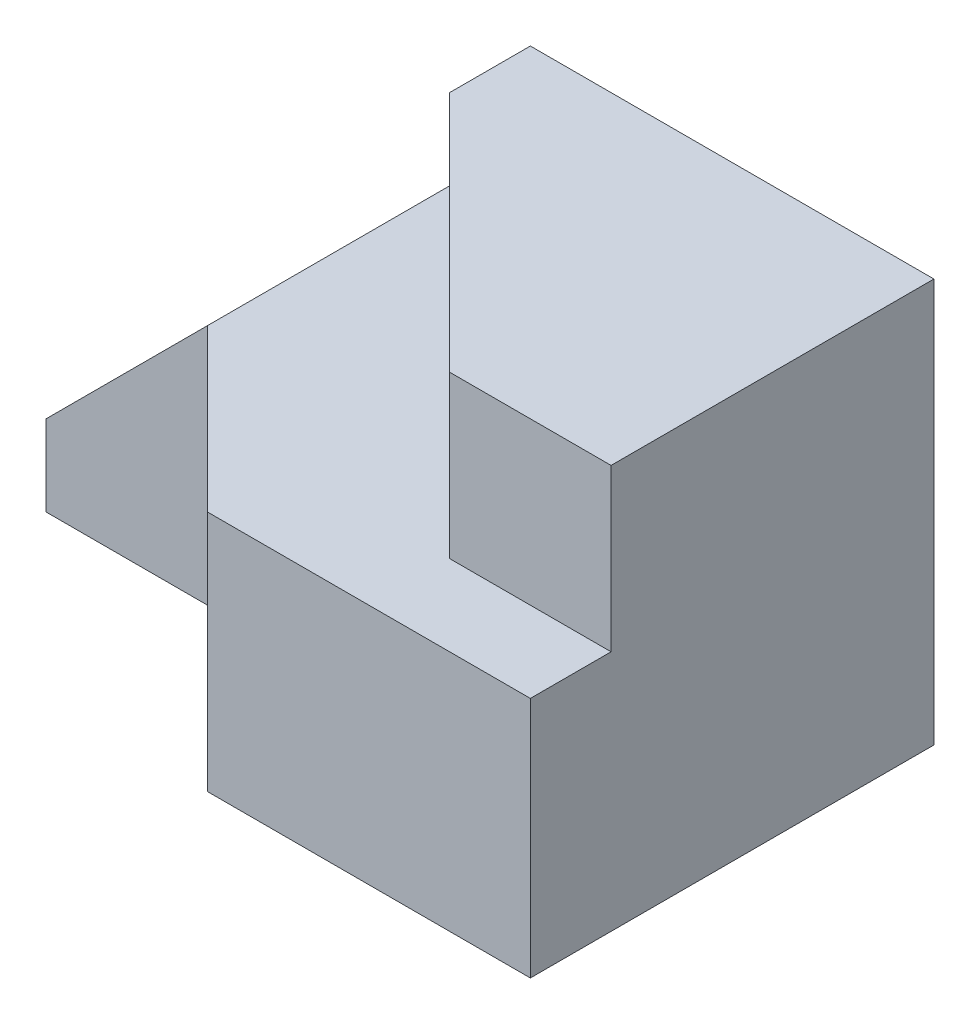
ISO-10303-21;
HEADER;
FILE_DESCRIPTION(('STEP AP214'),'2;1');
FILE_NAME('part.step','',(''),(''),'','','');
FILE_SCHEMA(('AUTOMOTIVE_DESIGN { 1 0 10303 214 1 1 1 1 }'));
ENDSEC;
DATA;
#1=APPLICATION_CONTEXT('core data for automotive mechanical design processes');
#2=APPLICATION_PROTOCOL_DEFINITION('international standard','automotive_design',2000,#1);
#3=PRODUCT_CONTEXT('',#1,'mechanical');
#4=PRODUCT('Part','Part','',(#3));
#5=PRODUCT_RELATED_PRODUCT_CATEGORY('part','',(#4));
#6=PRODUCT_DEFINITION_FORMATION('','',#4);
#7=PRODUCT_DEFINITION_CONTEXT('part definition',#1,'design');
#8=PRODUCT_DEFINITION('design','',#6,#7);
#9=PRODUCT_DEFINITION_SHAPE('','',#8);
#10=(LENGTH_UNIT() NAMED_UNIT(*) SI_UNIT(.MILLI.,.METRE.));
#11=(NAMED_UNIT(*) PLANE_ANGLE_UNIT() SI_UNIT($,.RADIAN.));
#12=(NAMED_UNIT(*) SI_UNIT($,.STERADIAN.) SOLID_ANGLE_UNIT());
#13=UNCERTAINTY_MEASURE_WITH_UNIT(LENGTH_MEASURE(1.E-05),#10,'distance_accuracy_value','');
#14=(GEOMETRIC_REPRESENTATION_CONTEXT(3) GLOBAL_UNCERTAINTY_ASSIGNED_CONTEXT((#13)) GLOBAL_UNIT_ASSIGNED_CONTEXT((#10,
#11,#12)) REPRESENTATION_CONTEXT('',''));
#15=CARTESIAN_POINT('',(0.,0.,0.));
#16=DIRECTION('',(0.,0.,1.));
#17=DIRECTION('',(1.,0.,0.));
#18=AXIS2_PLACEMENT_3D('',#15,#16,#17);
#19=CARTESIAN_POINT('',(0.,30.,0.));
#20=DIRECTION('',(0.,-1.,0.));
#21=DIRECTION('',(0.,0.,-1.));
#22=AXIS2_PLACEMENT_3D('',#19,#20,#21);
#23=PLANE('',#22);
#24=DIRECTION('',(0.,0.,1.));
#25=VECTOR('',#24,1.);
#26=CARTESIAN_POINT('',(10.,30.,-40.));
#27=LINE('',#26,#25);
#28=CARTESIAN_POINT('',(10.,30.,-50.));
#29=VERTEX_POINT('',#28);
#30=CARTESIAN_POINT('',(10.,30.,-40.));
#31=VERTEX_POINT('',#30);
#32=EDGE_CURVE('E57',#29,#31,#27,.T.);
#33=ORIENTED_EDGE('',*,*,#32,.F.);
#34=DIRECTION('',(-1.,0.,0.));
#35=VECTOR('',#34,1.);
#36=CARTESIAN_POINT('',(0.,30.,-50.));
#37=LINE('',#36,#35);
#38=CARTESIAN_POINT('',(0.,30.,-50.));
#39=VERTEX_POINT('',#38);
#40=EDGE_CURVE('E189',#29,#39,#37,.T.);
#41=ORIENTED_EDGE('',*,*,#40,.T.);
#42=DIRECTION('',(0.,0.,1.));
#43=VECTOR('',#42,1.);
#44=CARTESIAN_POINT('',(0.,30.,0.));
#45=LINE('',#44,#43);
#46=CARTESIAN_POINT('',(0.,30.,-20.));
#47=VERTEX_POINT('',#46);
#48=EDGE_CURVE('E205',#39,#47,#45,.T.);
#49=ORIENTED_EDGE('',*,*,#48,.T.);
#50=DIRECTION('',(-0.707106781186548,0.,-0.707106781186548));
#51=VECTOR('',#50,1.);
#52=CARTESIAN_POINT('',(0.,30.,-20.));
#53=LINE('',#52,#51);
#54=CARTESIAN_POINT('',(20.,30.,0.));
#55=VERTEX_POINT('',#54);
#56=EDGE_CURVE('E222',#55,#47,#53,.T.);
#57=ORIENTED_EDGE('',*,*,#56,.F.);
#58=DIRECTION('',(1.,0.,0.));
#59=VECTOR('',#58,1.);
#60=CARTESIAN_POINT('',(0.,30.,0.));
#61=LINE('',#60,#59);
#62=CARTESIAN_POINT('',(60.,30.,0.));
#63=VERTEX_POINT('',#62);
#64=EDGE_CURVE('E216',#55,#63,#61,.T.);
#65=ORIENTED_EDGE('',*,*,#64,.T.);
#66=DIRECTION('',(0.,0.,-1.));
#67=VECTOR('',#66,1.);
#68=CARTESIAN_POINT('',(60.,30.,0.));
#69=LINE('',#68,#67);
#70=CARTESIAN_POINT('',(60.,30.,-10.));
#71=VERTEX_POINT('',#70);
#72=EDGE_CURVE('E192',#63,#71,#69,.T.);
#73=ORIENTED_EDGE('',*,*,#72,.T.);
#74=DIRECTION('',(1.,0.,0.));
#75=VECTOR('',#74,1.);
#76=CARTESIAN_POINT('',(60.,30.,-10.));
#77=LINE('',#76,#75);
#78=CARTESIAN_POINT('',(40.,30.,-10.));
#79=VERTEX_POINT('',#78);
#80=EDGE_CURVE('E153',#79,#71,#77,.T.);
#81=ORIENTED_EDGE('',*,*,#80,.F.);
#82=DIRECTION('',(0.707106781186548,0.,0.707106781186547));
#83=VECTOR('',#82,1.);
#84=CARTESIAN_POINT('',(40.,30.,-10.));
#85=LINE('',#84,#83);
#86=EDGE_CURVE('E52',#31,#79,#85,.T.);
#87=ORIENTED_EDGE('',*,*,#86,.F.);
#88=EDGE_LOOP('',(#33,#41,#49,#57,#65,#73,#81,#87));
#89=FACE_BOUND('',#88,.T.);
#90=ADVANCED_FACE('F35',(#89),#23,.F.);
#91=CARTESIAN_POINT('',(0.,30.,0.));
#92=DIRECTION('',(0.,0.,-1.));
#93=DIRECTION('',(-1.,0.,0.));
#94=AXIS2_PLACEMENT_3D('',#91,#92,#93);
#95=PLANE('',#94);
#96=ORIENTED_EDGE('',*,*,#64,.F.);
#97=DIRECTION('',(0.,1.,0.));
#98=VECTOR('',#97,1.);
#99=CARTESIAN_POINT('',(20.,0.,0.));
#100=LINE('',#99,#98);
#101=CARTESIAN_POINT('',(20.,0.,0.));
#102=VERTEX_POINT('',#101);
#103=EDGE_CURVE('E217',#102,#55,#100,.T.);
#104=ORIENTED_EDGE('',*,*,#103,.F.);
#105=DIRECTION('',(1.,0.,0.));
#106=VECTOR('',#105,1.);
#107=CARTESIAN_POINT('',(0.,0.,0.));
#108=LINE('',#107,#106);
#109=CARTESIAN_POINT('',(60.,0.,0.));
#110=VERTEX_POINT('',#109);
#111=EDGE_CURVE('E198',#102,#110,#108,.T.);
#112=ORIENTED_EDGE('',*,*,#111,.T.);
#113=DIRECTION('',(0.,-1.,0.));
#114=VECTOR('',#113,1.);
#115=CARTESIAN_POINT('',(60.,30.,0.));
#116=LINE('',#115,#114);
#117=EDGE_CURVE('E11',#63,#110,#116,.T.);
#118=ORIENTED_EDGE('',*,*,#117,.F.);
#119=EDGE_LOOP('',(#96,#104,#112,#118));
#120=FACE_BOUND('',#119,.T.);
#121=ADVANCED_FACE('F37',(#120),#95,.F.);
#122=CARTESIAN_POINT('',(60.,30.,0.));
#123=DIRECTION('',(-1.,0.,0.));
#124=DIRECTION('',(0.,0.,1.));
#125=AXIS2_PLACEMENT_3D('',#122,#123,#124);
#126=PLANE('',#125);
#127=DIRECTION('',(0.,0.,-1.));
#128=VECTOR('',#127,1.);
#129=CARTESIAN_POINT('',(60.,0.,0.));
#130=LINE('',#129,#128);
#131=CARTESIAN_POINT('',(60.,0.,-50.));
#132=VERTEX_POINT('',#131);
#133=EDGE_CURVE('E200',#110,#132,#130,.T.);
#134=ORIENTED_EDGE('',*,*,#133,.T.);
#135=DIRECTION('',(0.,-1.,0.));
#136=VECTOR('',#135,1.);
#137=CARTESIAN_POINT('',(60.,30.,-50.));
#138=LINE('',#137,#136);
#139=CARTESIAN_POINT('',(60.,50.,-50.));
#140=VERTEX_POINT('',#139);
#141=EDGE_CURVE('E44',#140,#132,#138,.T.);
#142=ORIENTED_EDGE('',*,*,#141,.F.);
#143=DIRECTION('',(0.,0.,-1.));
#144=VECTOR('',#143,1.);
#145=CARTESIAN_POINT('',(60.,50.,-50.));
#146=LINE('',#145,#144);
#147=CARTESIAN_POINT('',(60.,50.,-10.));
#148=VERTEX_POINT('',#147);
#149=EDGE_CURVE('E157',#148,#140,#146,.T.);
#150=ORIENTED_EDGE('',*,*,#149,.F.);
#151=DIRECTION('',(0.,-1.,0.));
#152=VECTOR('',#151,1.);
#153=CARTESIAN_POINT('',(60.,50.,-10.));
#154=LINE('',#153,#152);
#155=EDGE_CURVE('E173',#148,#71,#154,.T.);
#156=ORIENTED_EDGE('',*,*,#155,.T.);
#157=ORIENTED_EDGE('',*,*,#72,.F.);
#158=ORIENTED_EDGE('',*,*,#117,.T.);
#159=EDGE_LOOP('',(#134,#142,#150,#156,#157,#158));
#160=FACE_BOUND('',#159,.T.);
#161=ADVANCED_FACE('F211',(#160),#126,.F.);
#162=CARTESIAN_POINT('',(0.,30.,-50.));
#163=DIRECTION('',(0.,0.,1.));
#164=DIRECTION('',(1.,0.,0.));
#165=AXIS2_PLACEMENT_3D('',#162,#163,#164);
#166=PLANE('',#165);
#167=DIRECTION('',(-1.,0.,0.));
#168=VECTOR('',#167,1.);
#169=CARTESIAN_POINT('',(0.,0.,-50.));
#170=LINE('',#169,#168);
#171=CARTESIAN_POINT('',(-20.,0.,-50.));
#172=VERTEX_POINT('',#171);
#173=EDGE_CURVE('E203',#132,#172,#170,.T.);
#174=ORIENTED_EDGE('',*,*,#173,.T.);
#175=DIRECTION('',(0.,1.,0.));
#176=VECTOR('',#175,1.);
#177=CARTESIAN_POINT('',(-20.,0.,-50.));
#178=LINE('',#177,#176);
#179=CARTESIAN_POINT('',(-20.,10.,-50.));
#180=VERTEX_POINT('',#179);
#181=EDGE_CURVE('E122',#172,#180,#178,.T.);
#182=ORIENTED_EDGE('',*,*,#181,.T.);
#183=DIRECTION('',(0.707106781186548,0.707106781186547,0.));
#184=VECTOR('',#183,1.);
#185=CARTESIAN_POINT('',(-15.,15.,-50.));
#186=LINE('',#185,#184);
#187=EDGE_CURVE('E141',#180,#39,#186,.T.);
#188=ORIENTED_EDGE('',*,*,#187,.T.);
#189=ORIENTED_EDGE('',*,*,#40,.F.);
#190=DIRECTION('',(0.,-1.,0.));
#191=VECTOR('',#190,1.);
#192=CARTESIAN_POINT('',(10.,50.,-50.));
#193=LINE('',#192,#191);
#194=CARTESIAN_POINT('',(10.,50.,-50.));
#195=VERTEX_POINT('',#194);
#196=EDGE_CURVE('E162',#195,#29,#193,.T.);
#197=ORIENTED_EDGE('',*,*,#196,.F.);
#198=DIRECTION('',(-1.,0.,0.));
#199=VECTOR('',#198,1.);
#200=CARTESIAN_POINT('',(10.,50.,-50.));
#201=LINE('',#200,#199);
#202=EDGE_CURVE('E160',#140,#195,#201,.T.);
#203=ORIENTED_EDGE('',*,*,#202,.F.);
#204=ORIENTED_EDGE('',*,*,#141,.T.);
#205=EDGE_LOOP('',(#174,#182,#188,#189,#197,#203,#204));
#206=FACE_BOUND('',#205,.T.);
#207=ADVANCED_FACE('F209',(#206),#166,.F.);
#208=CARTESIAN_POINT('',(0.,0.,0.));
#209=DIRECTION('',(0.,-1.,0.));
#210=DIRECTION('',(0.,0.,-1.));
#211=AXIS2_PLACEMENT_3D('',#208,#209,#210);
#212=PLANE('',#211);
#213=DIRECTION('',(-0.707106781186548,0.,-0.707106781186548));
#214=VECTOR('',#213,1.);
#215=CARTESIAN_POINT('',(0.,0.,-20.));
#216=LINE('',#215,#214);
#217=CARTESIAN_POINT('',(0.,0.,-20.));
#218=VERTEX_POINT('',#217);
#219=EDGE_CURVE('E140',#102,#218,#216,.T.);
#220=ORIENTED_EDGE('',*,*,#219,.T.);
#221=DIRECTION('',(-1.,0.,0.));
#222=VECTOR('',#221,1.);
#223=CARTESIAN_POINT('',(0.,0.,-20.));
#224=LINE('',#223,#222);
#225=CARTESIAN_POINT('',(-20.,0.,-20.));
#226=VERTEX_POINT('',#225);
#227=EDGE_CURVE('E134',#218,#226,#224,.T.);
#228=ORIENTED_EDGE('',*,*,#227,.T.);
#229=DIRECTION('',(0.,0.,-1.));
#230=VECTOR('',#229,1.);
#231=CARTESIAN_POINT('',(-20.,0.,-20.));
#232=LINE('',#231,#230);
#233=EDGE_CURVE('E117',#226,#172,#232,.T.);
#234=ORIENTED_EDGE('',*,*,#233,.T.);
#235=ORIENTED_EDGE('',*,*,#173,.F.);
#236=ORIENTED_EDGE('',*,*,#133,.F.);
#237=ORIENTED_EDGE('',*,*,#111,.F.);
#238=EDGE_LOOP('',(#220,#228,#234,#235,#236,#237));
#239=FACE_BOUND('',#238,.T.);
#240=ADVANCED_FACE('F138',(#239),#212,.T.);
#241=CARTESIAN_POINT('',(0.,0.,-20.));
#242=DIRECTION('',(0.707106781186547,0.,-0.707106781186547));
#243=DIRECTION('',(-0.707106781186548,0.,-0.707106781186548));
#244=AXIS2_PLACEMENT_3D('',#241,#242,#243);
#245=PLANE('',#244);
#246=ORIENTED_EDGE('',*,*,#56,.T.);
#247=DIRECTION('',(0.,1.,0.));
#248=VECTOR('',#247,1.);
#249=CARTESIAN_POINT('',(0.,0.,-20.));
#250=LINE('',#249,#248);
#251=EDGE_CURVE('E201',#218,#47,#250,.T.);
#252=ORIENTED_EDGE('',*,*,#251,.F.);
#253=ORIENTED_EDGE('',*,*,#219,.F.);
#254=ORIENTED_EDGE('',*,*,#103,.T.);
#255=EDGE_LOOP('',(#246,#252,#253,#254));
#256=FACE_BOUND('',#255,.T.);
#257=ADVANCED_FACE('F236',(#256),#245,.F.);
#258=CARTESIAN_POINT('',(10.,50.,-40.));
#259=DIRECTION('',(1.,0.,0.));
#260=DIRECTION('',(0.,0.,-1.));
#261=AXIS2_PLACEMENT_3D('',#258,#259,#260);
#262=PLANE('',#261);
#263=ORIENTED_EDGE('',*,*,#32,.T.);
#264=DIRECTION('',(0.,-1.,0.));
#265=VECTOR('',#264,1.);
#266=CARTESIAN_POINT('',(10.,50.,-40.));
#267=LINE('',#266,#265);
#268=CARTESIAN_POINT('',(10.,50.,-40.));
#269=VERTEX_POINT('',#268);
#270=EDGE_CURVE('E180',#269,#31,#267,.T.);
#271=ORIENTED_EDGE('',*,*,#270,.F.);
#272=DIRECTION('',(0.,0.,1.));
#273=VECTOR('',#272,1.);
#274=CARTESIAN_POINT('',(10.,50.,-40.));
#275=LINE('',#274,#273);
#276=EDGE_CURVE('E149',#195,#269,#275,.T.);
#277=ORIENTED_EDGE('',*,*,#276,.F.);
#278=ORIENTED_EDGE('',*,*,#196,.T.);
#279=EDGE_LOOP('',(#263,#271,#277,#278));
#280=FACE_BOUND('',#279,.T.);
#281=ADVANCED_FACE('F234',(#280),#262,.F.);
#282=CARTESIAN_POINT('',(40.,50.,-10.));
#283=DIRECTION('',(0.707106781186547,0.,-0.707106781186548));
#284=DIRECTION('',(-0.707106781186548,0.,-0.707106781186547));
#285=AXIS2_PLACEMENT_3D('',#282,#283,#284);
#286=PLANE('',#285);
#287=ORIENTED_EDGE('',*,*,#86,.T.);
#288=DIRECTION('',(0.,-1.,0.));
#289=VECTOR('',#288,1.);
#290=CARTESIAN_POINT('',(40.,50.,-10.));
#291=LINE('',#290,#289);
#292=CARTESIAN_POINT('',(40.,50.,-10.));
#293=VERTEX_POINT('',#292);
#294=EDGE_CURVE('E166',#293,#79,#291,.T.);
#295=ORIENTED_EDGE('',*,*,#294,.F.);
#296=DIRECTION('',(0.707106781186548,0.,0.707106781186547));
#297=VECTOR('',#296,1.);
#298=CARTESIAN_POINT('',(40.,50.,-10.));
#299=LINE('',#298,#297);
#300=EDGE_CURVE('E152',#269,#293,#299,.T.);
#301=ORIENTED_EDGE('',*,*,#300,.F.);
#302=ORIENTED_EDGE('',*,*,#270,.T.);
#303=EDGE_LOOP('',(#287,#295,#301,#302));
#304=FACE_BOUND('',#303,.T.);
#305=ADVANCED_FACE('F232',(#304),#286,.F.);
#306=CARTESIAN_POINT('',(60.,50.,-10.));
#307=DIRECTION('',(0.,0.,-1.));
#308=DIRECTION('',(-1.,0.,0.));
#309=AXIS2_PLACEMENT_3D('',#306,#307,#308);
#310=PLANE('',#309);
#311=ORIENTED_EDGE('',*,*,#80,.T.);
#312=ORIENTED_EDGE('',*,*,#155,.F.);
#313=DIRECTION('',(1.,0.,0.));
#314=VECTOR('',#313,1.);
#315=CARTESIAN_POINT('',(60.,50.,-10.));
#316=LINE('',#315,#314);
#317=EDGE_CURVE('E155',#293,#148,#316,.T.);
#318=ORIENTED_EDGE('',*,*,#317,.F.);
#319=ORIENTED_EDGE('',*,*,#294,.T.);
#320=EDGE_LOOP('',(#311,#312,#318,#319));
#321=FACE_BOUND('',#320,.T.);
#322=ADVANCED_FACE('F228',(#321),#310,.F.);
#323=CARTESIAN_POINT('',(0.,50.,0.));
#324=DIRECTION('',(0.,-1.,0.));
#325=DIRECTION('',(0.,0.,-1.));
#326=AXIS2_PLACEMENT_3D('',#323,#324,#325);
#327=PLANE('',#326);
#328=ORIENTED_EDGE('',*,*,#276,.T.);
#329=ORIENTED_EDGE('',*,*,#300,.T.);
#330=ORIENTED_EDGE('',*,*,#317,.T.);
#331=ORIENTED_EDGE('',*,*,#149,.T.);
#332=ORIENTED_EDGE('',*,*,#202,.T.);
#333=EDGE_LOOP('',(#328,#329,#330,#331,#332));
#334=FACE_BOUND('',#333,.T.);
#335=ADVANCED_FACE('F282',(#334),#327,.F.);
#336=CARTESIAN_POINT('',(-15.,15.,-20.));
#337=DIRECTION('',(-0.707106781186547,0.707106781186548,0.));
#338=DIRECTION('',(-0.707106781186548,-0.707106781186547,0.));
#339=AXIS2_PLACEMENT_3D('',#336,#337,#338);
#340=PLANE('',#339);
#341=ORIENTED_EDGE('',*,*,#187,.F.);
#342=DIRECTION('',(0.,0.,-1.));
#343=VECTOR('',#342,1.);
#344=CARTESIAN_POINT('',(-20.,10.,-20.));
#345=LINE('',#344,#343);
#346=CARTESIAN_POINT('',(-20.,10.,-20.));
#347=VERTEX_POINT('',#346);
#348=EDGE_CURVE('E126',#347,#180,#345,.T.);
#349=ORIENTED_EDGE('',*,*,#348,.F.);
#350=DIRECTION('',(0.707106781186548,0.707106781186547,0.));
#351=VECTOR('',#350,1.);
#352=CARTESIAN_POINT('',(-15.,15.,-20.));
#353=LINE('',#352,#351);
#354=EDGE_CURVE('E127',#347,#47,#353,.T.);
#355=ORIENTED_EDGE('',*,*,#354,.T.);
#356=ORIENTED_EDGE('',*,*,#48,.F.);
#357=EDGE_LOOP('',(#341,#349,#355,#356));
#358=FACE_BOUND('',#357,.T.);
#359=ADVANCED_FACE('F277',(#358),#340,.T.);
#360=CARTESIAN_POINT('',(-20.,0.,-20.));
#361=DIRECTION('',(-1.,0.,0.));
#362=DIRECTION('',(0.,0.,1.));
#363=AXIS2_PLACEMENT_3D('',#360,#361,#362);
#364=PLANE('',#363);
#365=ORIENTED_EDGE('',*,*,#181,.F.);
#366=ORIENTED_EDGE('',*,*,#233,.F.);
#367=DIRECTION('',(0.,1.,0.));
#368=VECTOR('',#367,1.);
#369=CARTESIAN_POINT('',(-20.,0.,-20.));
#370=LINE('',#369,#368);
#371=EDGE_CURVE('E120',#226,#347,#370,.T.);
#372=ORIENTED_EDGE('',*,*,#371,.T.);
#373=ORIENTED_EDGE('',*,*,#348,.T.);
#374=EDGE_LOOP('',(#365,#366,#372,#373));
#375=FACE_BOUND('',#374,.T.);
#376=ADVANCED_FACE('F119',(#375),#364,.T.);
#377=CARTESIAN_POINT('',(0.,0.,-20.));
#378=DIRECTION('',(0.,0.,-1.));
#379=DIRECTION('',(-1.,0.,0.));
#380=AXIS2_PLACEMENT_3D('',#377,#378,#379);
#381=PLANE('',#380);
#382=ORIENTED_EDGE('',*,*,#227,.F.);
#383=ORIENTED_EDGE('',*,*,#251,.T.);
#384=ORIENTED_EDGE('',*,*,#354,.F.);
#385=ORIENTED_EDGE('',*,*,#371,.F.);
#386=EDGE_LOOP('',(#382,#383,#384,#385));
#387=FACE_BOUND('',#386,.T.);
#388=ADVANCED_FACE('F132',(#387),#381,.F.);
#389=CLOSED_SHELL('',(#90,#121,#161,#207,#240,#257,#281,#305,#322,#335,#359,#376,#388));
#390=MANIFOLD_SOLID_BREP('B2',#389);
#391=ADVANCED_BREP_SHAPE_REPRESENTATION('',(#18,#390),#14);
#392=SHAPE_DEFINITION_REPRESENTATION(#9,#391);
ENDSEC;
END-ISO-10303-21;
